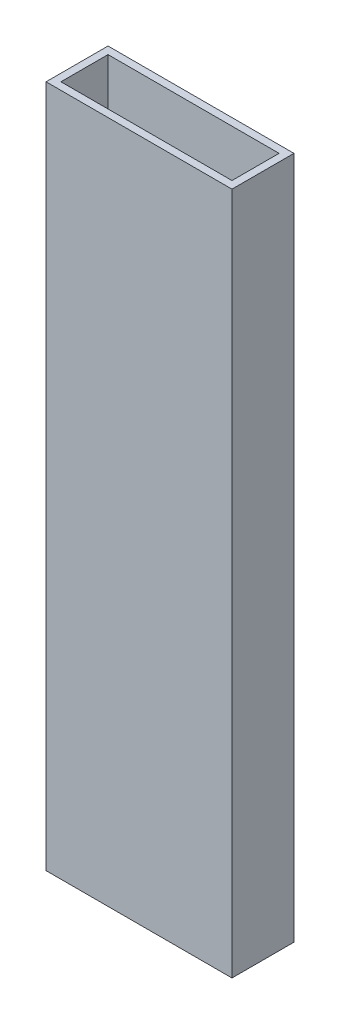
ISO-10303-21;
HEADER;
FILE_DESCRIPTION(('STEP AP214'),'2;1');
FILE_NAME('part.step','',(''),(''),'','','');
FILE_SCHEMA(('AUTOMOTIVE_DESIGN { 1 0 10303 214 1 1 1 1 }'));
ENDSEC;
DATA;
#1=APPLICATION_CONTEXT('core data for automotive mechanical design processes');
#2=APPLICATION_PROTOCOL_DEFINITION('international standard','automotive_design',2000,#1);
#3=PRODUCT_CONTEXT('',#1,'mechanical');
#4=PRODUCT('Part','Part','',(#3));
#5=PRODUCT_RELATED_PRODUCT_CATEGORY('part','',(#4));
#6=PRODUCT_DEFINITION_FORMATION('','',#4);
#7=PRODUCT_DEFINITION_CONTEXT('part definition',#1,'design');
#8=PRODUCT_DEFINITION('design','',#6,#7);
#9=PRODUCT_DEFINITION_SHAPE('','',#8);
#10=(LENGTH_UNIT() NAMED_UNIT(*) SI_UNIT(.MILLI.,.METRE.));
#11=(NAMED_UNIT(*) PLANE_ANGLE_UNIT() SI_UNIT($,.RADIAN.));
#12=(NAMED_UNIT(*) SI_UNIT($,.STERADIAN.) SOLID_ANGLE_UNIT());
#13=UNCERTAINTY_MEASURE_WITH_UNIT(LENGTH_MEASURE(1.E-05),#10,'distance_accuracy_value','');
#14=(GEOMETRIC_REPRESENTATION_CONTEXT(3) GLOBAL_UNCERTAINTY_ASSIGNED_CONTEXT((#13)) GLOBAL_UNIT_ASSIGNED_CONTEXT((#10,
#11,#12)) REPRESENTATION_CONTEXT('',''));
#15=CARTESIAN_POINT('',(0.,0.,0.));
#16=DIRECTION('',(0.,0.,1.));
#17=DIRECTION('',(1.,0.,0.));
#18=AXIS2_PLACEMENT_3D('',#15,#16,#17);
#19=CARTESIAN_POINT('',(-38.1,305.4,-12.7));
#20=DIRECTION('',(1.,0.,0.));
#21=DIRECTION('',(0.,0.,-1.));
#22=AXIS2_PLACEMENT_3D('',#19,#20,#21);
#23=PLANE('',#22);
#24=DIRECTION('',(0.,0.,-1.));
#25=VECTOR('',#24,1.);
#26=CARTESIAN_POINT('',(-38.1,292.7,502.952333190097));
#27=LINE('',#26,#25);
#28=CARTESIAN_POINT('',(-38.1,292.7,12.7));
#29=VERTEX_POINT('',#28);
#30=CARTESIAN_POINT('',(-38.1,292.7,-12.7));
#31=VERTEX_POINT('',#30);
#32=EDGE_CURVE('E100',#29,#31,#27,.T.);
#33=ORIENTED_EDGE('',*,*,#32,.T.);
#34=DIRECTION('',(0.,-1.,0.));
#35=VECTOR('',#34,1.);
#36=CARTESIAN_POINT('',(-38.1,305.4,-12.7));
#37=LINE('',#36,#35);
#38=CARTESIAN_POINT('',(-38.1,12.7,-12.7));
#39=VERTEX_POINT('',#38);
#40=EDGE_CURVE('E122',#31,#39,#37,.T.);
#41=ORIENTED_EDGE('',*,*,#40,.T.);
#42=DIRECTION('',(0.,0.,-1.));
#43=VECTOR('',#42,1.);
#44=CARTESIAN_POINT('',(-38.1,12.7,502.952333190097));
#45=LINE('',#44,#43);
#46=CARTESIAN_POINT('',(-38.1,12.7,12.7));
#47=VERTEX_POINT('',#46);
#48=EDGE_CURVE('E104',#47,#39,#45,.T.);
#49=ORIENTED_EDGE('',*,*,#48,.F.);
#50=DIRECTION('',(0.,-1.,0.));
#51=VECTOR('',#50,1.);
#52=CARTESIAN_POINT('',(-38.1,305.4,12.7));
#53=LINE('',#52,#51);
#54=EDGE_CURVE('E119',#29,#47,#53,.T.);
#55=ORIENTED_EDGE('',*,*,#54,.F.);
#56=EDGE_LOOP('',(#33,#41,#49,#55));
#57=FACE_BOUND('',#56,.T.);
#58=ADVANCED_FACE('F36',(#57),#23,.F.);
#59=CARTESIAN_POINT('',(-38.1,305.4,12.7));
#60=DIRECTION('',(0.,0.,-1.));
#61=DIRECTION('',(-1.,0.,0.));
#62=AXIS2_PLACEMENT_3D('',#59,#60,#61);
#63=PLANE('',#62);
#64=DIRECTION('',(1.,0.,0.));
#65=VECTOR('',#64,1.);
#66=CARTESIAN_POINT('',(-38.1,292.7,12.7));
#67=LINE('',#66,#65);
#68=CARTESIAN_POINT('',(38.1,292.7,12.7));
#69=VERTEX_POINT('',#68);
#70=EDGE_CURVE('E97',#29,#69,#67,.T.);
#71=ORIENTED_EDGE('',*,*,#70,.F.);
#72=ORIENTED_EDGE('',*,*,#54,.T.);
#73=DIRECTION('',(-1.,0.,0.));
#74=VECTOR('',#73,1.);
#75=CARTESIAN_POINT('',(-38.0999999999999,12.6999999999999,12.7));
#76=LINE('',#75,#74);
#77=CARTESIAN_POINT('',(38.1,12.7,12.7));
#78=VERTEX_POINT('',#77);
#79=EDGE_CURVE('E118',#78,#47,#76,.T.);
#80=ORIENTED_EDGE('',*,*,#79,.F.);
#81=DIRECTION('',(0.,-1.,0.));
#82=VECTOR('',#81,1.);
#83=CARTESIAN_POINT('',(38.1,305.4,12.7));
#84=LINE('',#83,#82);
#85=EDGE_CURVE('E111',#69,#78,#84,.T.);
#86=ORIENTED_EDGE('',*,*,#85,.F.);
#87=EDGE_LOOP('',(#71,#72,#80,#86));
#88=FACE_BOUND('',#87,.T.);
#89=ADVANCED_FACE('F116',(#88),#63,.F.);
#90=CARTESIAN_POINT('',(38.1,305.4,-12.7));
#91=DIRECTION('',(-1.,0.,0.));
#92=DIRECTION('',(0.,0.,1.));
#93=AXIS2_PLACEMENT_3D('',#90,#91,#92);
#94=PLANE('',#93);
#95=DIRECTION('',(0.,0.,-1.));
#96=VECTOR('',#95,1.);
#97=CARTESIAN_POINT('',(38.1,292.7,502.952333190097));
#98=LINE('',#97,#96);
#99=CARTESIAN_POINT('',(38.1,292.7,-12.7));
#100=VERTEX_POINT('',#99);
#101=EDGE_CURVE('E50',#69,#100,#98,.T.);
#102=ORIENTED_EDGE('',*,*,#101,.F.);
#103=ORIENTED_EDGE('',*,*,#85,.T.);
#104=DIRECTION('',(0.,0.,-1.));
#105=VECTOR('',#104,1.);
#106=CARTESIAN_POINT('',(38.1,12.7,502.952333190097));
#107=LINE('',#106,#105);
#108=CARTESIAN_POINT('',(38.1,12.7,-12.7));
#109=VERTEX_POINT('',#108);
#110=EDGE_CURVE('E167',#78,#109,#107,.T.);
#111=ORIENTED_EDGE('',*,*,#110,.T.);
#112=DIRECTION('',(0.,-1.,0.));
#113=VECTOR('',#112,1.);
#114=CARTESIAN_POINT('',(38.1,305.4,-12.7));
#115=LINE('',#114,#113);
#116=EDGE_CURVE('E113',#100,#109,#115,.T.);
#117=ORIENTED_EDGE('',*,*,#116,.F.);
#118=EDGE_LOOP('',(#102,#103,#111,#117));
#119=FACE_BOUND('',#118,.T.);
#120=ADVANCED_FACE('F109',(#119),#94,.F.);
#121=CARTESIAN_POINT('',(-38.1,305.4,-12.7));
#122=DIRECTION('',(0.,0.,1.));
#123=DIRECTION('',(1.,0.,0.));
#124=AXIS2_PLACEMENT_3D('',#121,#122,#123);
#125=PLANE('',#124);
#126=DIRECTION('',(-1.,0.,0.));
#127=VECTOR('',#126,1.);
#128=CARTESIAN_POINT('',(-38.1,292.7,-12.7));
#129=LINE('',#128,#127);
#130=EDGE_CURVE('E105',#100,#31,#129,.T.);
#131=ORIENTED_EDGE('',*,*,#130,.F.);
#132=ORIENTED_EDGE('',*,*,#116,.T.);
#133=DIRECTION('',(1.,0.,0.));
#134=VECTOR('',#133,1.);
#135=CARTESIAN_POINT('',(-38.0999999999999,12.6999999999999,-12.7));
#136=LINE('',#135,#134);
#137=EDGE_CURVE('E148',#39,#109,#136,.T.);
#138=ORIENTED_EDGE('',*,*,#137,.F.);
#139=ORIENTED_EDGE('',*,*,#40,.F.);
#140=EDGE_LOOP('',(#131,#132,#138,#139));
#141=FACE_BOUND('',#140,.T.);
#142=ADVANCED_FACE('F169',(#141),#125,.F.);
#143=CARTESIAN_POINT('',(-35.052,305.4,-9.65199999999999));
#144=DIRECTION('',(1.,0.,0.));
#145=DIRECTION('',(0.,0.,-1.));
#146=AXIS2_PLACEMENT_3D('',#143,#144,#145);
#147=PLANE('',#146);
#148=DIRECTION('',(0.,-1.,0.));
#149=VECTOR('',#148,1.);
#150=CARTESIAN_POINT('',(-35.052,305.4,-9.65199999999999));
#151=LINE('',#150,#149);
#152=CARTESIAN_POINT('',(-35.052,292.7,-9.65199999999999));
#153=VERTEX_POINT('',#152);
#154=CARTESIAN_POINT('',(-35.052,12.6999999999999,-9.65199999999999));
#155=VERTEX_POINT('',#154);
#156=EDGE_CURVE('E132',#153,#155,#151,.T.);
#157=ORIENTED_EDGE('',*,*,#156,.F.);
#158=DIRECTION('',(0.,0.,1.));
#159=VECTOR('',#158,1.);
#160=CARTESIAN_POINT('',(-35.052,292.7,-9.65199999999999));
#161=LINE('',#160,#159);
#162=CARTESIAN_POINT('',(-35.052,292.7,9.652));
#163=VERTEX_POINT('',#162);
#164=EDGE_CURVE('E58',#153,#163,#161,.T.);
#165=ORIENTED_EDGE('',*,*,#164,.T.);
#166=DIRECTION('',(0.,-1.,0.));
#167=VECTOR('',#166,1.);
#168=CARTESIAN_POINT('',(-35.052,305.4,9.652));
#169=LINE('',#168,#167);
#170=CARTESIAN_POINT('',(-35.052,12.6999999999999,9.652));
#171=VERTEX_POINT('',#170);
#172=EDGE_CURVE('E147',#163,#171,#169,.T.);
#173=ORIENTED_EDGE('',*,*,#172,.T.);
#174=DIRECTION('',(0.,0.,-1.));
#175=VECTOR('',#174,1.);
#176=CARTESIAN_POINT('',(-35.052,12.6999999999999,-9.65199999999999));
#177=LINE('',#176,#175);
#178=EDGE_CURVE('E140',#171,#155,#177,.T.);
#179=ORIENTED_EDGE('',*,*,#178,.T.);
#180=EDGE_LOOP('',(#157,#165,#173,#179));
#181=FACE_BOUND('',#180,.T.);
#182=ADVANCED_FACE('F145',(#181),#147,.T.);
#183=CARTESIAN_POINT('',(-35.052,305.4,9.652));
#184=DIRECTION('',(0.,0.,-1.));
#185=DIRECTION('',(-1.,0.,0.));
#186=AXIS2_PLACEMENT_3D('',#183,#184,#185);
#187=PLANE('',#186);
#188=ORIENTED_EDGE('',*,*,#172,.F.);
#189=DIRECTION('',(1.,0.,0.));
#190=VECTOR('',#189,1.);
#191=CARTESIAN_POINT('',(-35.052,292.7,9.652));
#192=LINE('',#191,#190);
#193=CARTESIAN_POINT('',(35.052,292.7,9.65199999999999));
#194=VERTEX_POINT('',#193);
#195=EDGE_CURVE('E171',#163,#194,#192,.T.);
#196=ORIENTED_EDGE('',*,*,#195,.T.);
#197=DIRECTION('',(0.,-1.,0.));
#198=VECTOR('',#197,1.);
#199=CARTESIAN_POINT('',(35.052,305.4,9.65199999999999));
#200=LINE('',#199,#198);
#201=CARTESIAN_POINT('',(35.052,12.7,9.65199999999999));
#202=VERTEX_POINT('',#201);
#203=EDGE_CURVE('E159',#194,#202,#200,.T.);
#204=ORIENTED_EDGE('',*,*,#203,.T.);
#205=DIRECTION('',(-1.,0.,0.));
#206=VECTOR('',#205,1.);
#207=CARTESIAN_POINT('',(-35.0519999999999,12.6999999999999,9.652));
#208=LINE('',#207,#206);
#209=EDGE_CURVE('E149',#202,#171,#208,.T.);
#210=ORIENTED_EDGE('',*,*,#209,.T.);
#211=EDGE_LOOP('',(#188,#196,#204,#210));
#212=FACE_BOUND('',#211,.T.);
#213=ADVANCED_FACE('F184',(#212),#187,.T.);
#214=CARTESIAN_POINT('',(35.052,305.4,-9.652));
#215=DIRECTION('',(-1.,0.,0.));
#216=DIRECTION('',(0.,0.,1.));
#217=AXIS2_PLACEMENT_3D('',#214,#215,#216);
#218=PLANE('',#217);
#219=ORIENTED_EDGE('',*,*,#203,.F.);
#220=DIRECTION('',(0.,0.,-1.));
#221=VECTOR('',#220,1.);
#222=CARTESIAN_POINT('',(35.052,292.7,-9.652));
#223=LINE('',#222,#221);
#224=CARTESIAN_POINT('',(35.052,292.7,-9.652));
#225=VERTEX_POINT('',#224);
#226=EDGE_CURVE('E179',#194,#225,#223,.T.);
#227=ORIENTED_EDGE('',*,*,#226,.T.);
#228=DIRECTION('',(0.,-1.,0.));
#229=VECTOR('',#228,1.);
#230=CARTESIAN_POINT('',(35.052,305.4,-9.652));
#231=LINE('',#230,#229);
#232=CARTESIAN_POINT('',(35.052,12.6999999999999,-9.652));
#233=VERTEX_POINT('',#232);
#234=EDGE_CURVE('E130',#225,#233,#231,.T.);
#235=ORIENTED_EDGE('',*,*,#234,.T.);
#236=DIRECTION('',(0.,0.,1.));
#237=VECTOR('',#236,1.);
#238=CARTESIAN_POINT('',(35.052,12.7,-9.652));
#239=LINE('',#238,#237);
#240=EDGE_CURVE('E143',#233,#202,#239,.T.);
#241=ORIENTED_EDGE('',*,*,#240,.T.);
#242=EDGE_LOOP('',(#219,#227,#235,#241));
#243=FACE_BOUND('',#242,.T.);
#244=ADVANCED_FACE('F177',(#243),#218,.T.);
#245=CARTESIAN_POINT('',(-35.052,305.4,-9.65199999999999));
#246=DIRECTION('',(0.,0.,1.));
#247=DIRECTION('',(1.,0.,0.));
#248=AXIS2_PLACEMENT_3D('',#245,#246,#247);
#249=PLANE('',#248);
#250=ORIENTED_EDGE('',*,*,#234,.F.);
#251=DIRECTION('',(-1.,0.,0.));
#252=VECTOR('',#251,1.);
#253=CARTESIAN_POINT('',(-35.052,292.7,-9.65199999999999));
#254=LINE('',#253,#252);
#255=EDGE_CURVE('E11',#225,#153,#254,.T.);
#256=ORIENTED_EDGE('',*,*,#255,.T.);
#257=ORIENTED_EDGE('',*,*,#156,.T.);
#258=DIRECTION('',(1.,0.,0.));
#259=VECTOR('',#258,1.);
#260=CARTESIAN_POINT('',(-35.0519999999999,12.6999999999999,-9.65199999999999));
#261=LINE('',#260,#259);
#262=EDGE_CURVE('E43',#155,#233,#261,.T.);
#263=ORIENTED_EDGE('',*,*,#262,.T.);
#264=EDGE_LOOP('',(#250,#256,#257,#263));
#265=FACE_BOUND('',#264,.T.);
#266=ADVANCED_FACE('F129',(#265),#249,.T.);
#267=CARTESIAN_POINT('',(38.1,12.7,502.952333190097));
#268=DIRECTION('',(0.,-1.,0.));
#269=DIRECTION('',(1.,0.,0.));
#270=AXIS2_PLACEMENT_3D('',#267,#268,#269);
#271=PLANE('',#270);
#272=ORIENTED_EDGE('',*,*,#209,.F.);
#273=ORIENTED_EDGE('',*,*,#240,.F.);
#274=ORIENTED_EDGE('',*,*,#262,.F.);
#275=ORIENTED_EDGE('',*,*,#178,.F.);
#276=EDGE_LOOP('',(#272,#273,#274,#275));
#277=FACE_BOUND('',#276,.T.);
#278=ORIENTED_EDGE('',*,*,#79,.T.);
#279=ORIENTED_EDGE('',*,*,#48,.T.);
#280=ORIENTED_EDGE('',*,*,#137,.T.);
#281=ORIENTED_EDGE('',*,*,#110,.F.);
#282=EDGE_LOOP('',(#278,#279,#280,#281));
#283=FACE_BOUND('',#282,.T.);
#284=ADVANCED_FACE('F138',(#277,#283),#271,.T.);
#285=CARTESIAN_POINT('',(-38.1,292.7,502.952333190097));
#286=DIRECTION('',(0.,1.,0.));
#287=DIRECTION('',(0.,0.,1.));
#288=AXIS2_PLACEMENT_3D('',#285,#286,#287);
#289=PLANE('',#288);
#290=ORIENTED_EDGE('',*,*,#255,.F.);
#291=ORIENTED_EDGE('',*,*,#226,.F.);
#292=ORIENTED_EDGE('',*,*,#195,.F.);
#293=ORIENTED_EDGE('',*,*,#164,.F.);
#294=EDGE_LOOP('',(#290,#291,#292,#293));
#295=FACE_BOUND('',#294,.T.);
#296=ORIENTED_EDGE('',*,*,#70,.T.);
#297=ORIENTED_EDGE('',*,*,#101,.T.);
#298=ORIENTED_EDGE('',*,*,#130,.T.);
#299=ORIENTED_EDGE('',*,*,#32,.F.);
#300=EDGE_LOOP('',(#296,#297,#298,#299));
#301=FACE_BOUND('',#300,.T.);
#302=ADVANCED_FACE('F98',(#295,#301),#289,.T.);
#303=CLOSED_SHELL('',(#58,#89,#120,#142,#182,#213,#244,#266,#284,#302));
#304=MANIFOLD_SOLID_BREP('B2',#303);
#305=ADVANCED_BREP_SHAPE_REPRESENTATION('',(#18,#304),#14);
#306=SHAPE_DEFINITION_REPRESENTATION(#9,#305);
ENDSEC;
END-ISO-10303-21;
